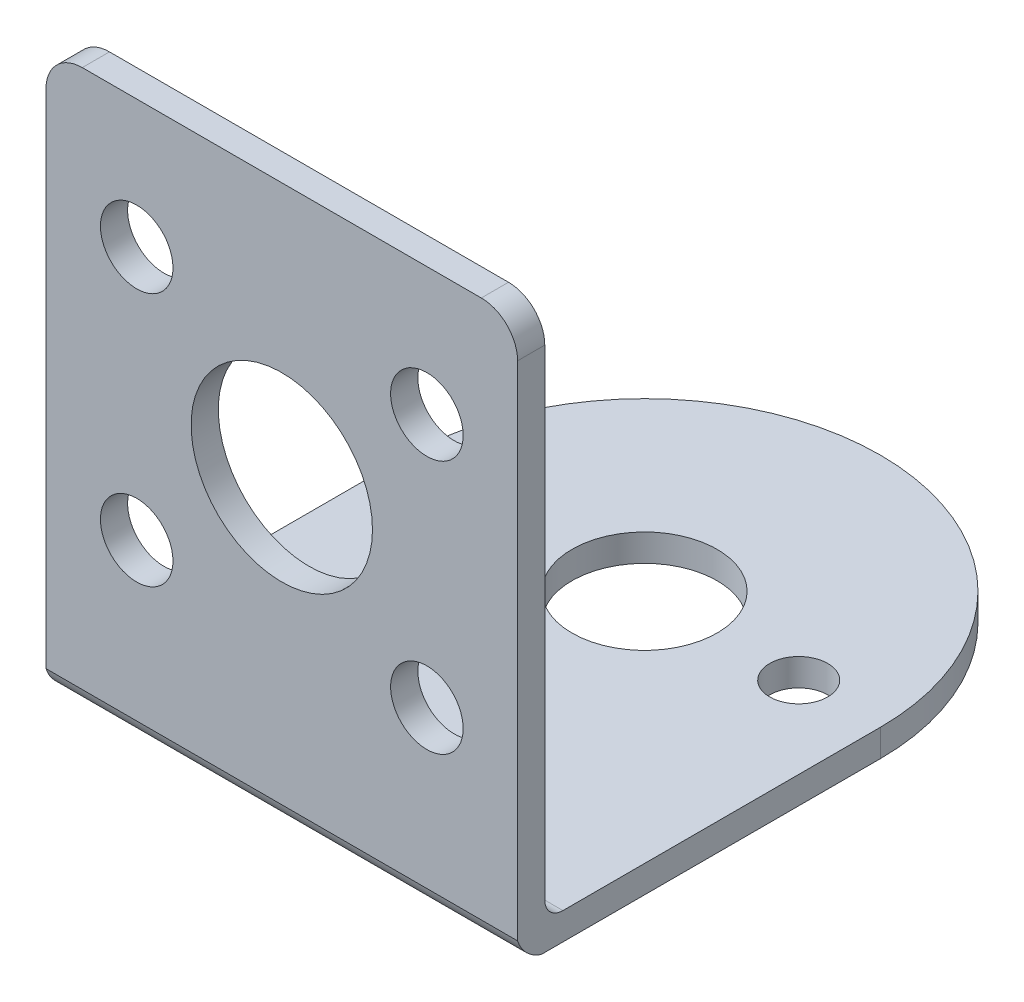
ISO-10303-21;
HEADER;
FILE_DESCRIPTION(('STEP AP214'),'2;1');
FILE_NAME('part.step','',(''),(''),'','','');
FILE_SCHEMA(('AUTOMOTIVE_DESIGN { 1 0 10303 214 1 1 1 1 }'));
ENDSEC;
DATA;
#1=APPLICATION_CONTEXT('core data for automotive mechanical design processes');
#2=APPLICATION_PROTOCOL_DEFINITION('international standard','automotive_design',2000,#1);
#3=PRODUCT_CONTEXT('',#1,'mechanical');
#4=PRODUCT('Part','Part','',(#3));
#5=PRODUCT_RELATED_PRODUCT_CATEGORY('part','',(#4));
#6=PRODUCT_DEFINITION_FORMATION('','',#4);
#7=PRODUCT_DEFINITION_CONTEXT('part definition',#1,'design');
#8=PRODUCT_DEFINITION('design','',#6,#7);
#9=PRODUCT_DEFINITION_SHAPE('','',#8);
#10=(LENGTH_UNIT() NAMED_UNIT(*) SI_UNIT(.MILLI.,.METRE.));
#11=(NAMED_UNIT(*) PLANE_ANGLE_UNIT() SI_UNIT($,.RADIAN.));
#12=(NAMED_UNIT(*) SI_UNIT($,.STERADIAN.) SOLID_ANGLE_UNIT());
#13=UNCERTAINTY_MEASURE_WITH_UNIT(LENGTH_MEASURE(1.E-05),#10,'distance_accuracy_value','');
#14=(GEOMETRIC_REPRESENTATION_CONTEXT(3) GLOBAL_UNCERTAINTY_ASSIGNED_CONTEXT((#13)) GLOBAL_UNIT_ASSIGNED_CONTEXT((#10,
#11,#12)) REPRESENTATION_CONTEXT('',''));
#15=CARTESIAN_POINT('',(0.,0.,0.));
#16=DIRECTION('',(0.,0.,1.));
#17=DIRECTION('',(1.,0.,0.));
#18=AXIS2_PLACEMENT_3D('',#15,#16,#17);
#19=CARTESIAN_POINT('',(0.,71.8431465541238,105.788232882787));
#20=DIRECTION('',(0.,-1.,0.));
#21=DIRECTION('',(0.,0.,-1.));
#22=AXIS2_PLACEMENT_3D('',#19,#20,#21);
#23=PLANE('',#22);
#24=CARTESIAN_POINT('',(-8.50000000000007,71.8431465541238,105.788232882787));
#25=DIRECTION('',(0.,1.,0.));
#26=DIRECTION('',(0.,0.,1.));
#27=AXIS2_PLACEMENT_3D('',#24,#25,#26);
#28=CIRCLE('',#27,1.6);
#29=CARTESIAN_POINT('',(-8.50000000000007,71.8431465541238,107.388232882787));
#30=VERTEX_POINT('',#29);
#31=EDGE_CURVE('E193',#30,#30,#28,.T.);
#32=ORIENTED_EDGE('',*,*,#31,.T.);
#33=EDGE_LOOP('',(#32));
#34=FACE_BOUND('',#33,.T.);
#35=CARTESIAN_POINT('',(0.,71.8431465541238,105.788232882787));
#36=DIRECTION('',(0.,1.,0.));
#37=DIRECTION('',(0.,0.,1.));
#38=AXIS2_PLACEMENT_3D('',#35,#36,#37);
#39=CIRCLE('',#38,4.);
#40=CARTESIAN_POINT('',(0.,71.8431465541238,109.788232882787));
#41=VERTEX_POINT('',#40);
#42=EDGE_CURVE('E199',#41,#41,#39,.T.);
#43=ORIENTED_EDGE('',*,*,#42,.T.);
#44=EDGE_LOOP('',(#43));
#45=FACE_BOUND('',#44,.T.);
#46=CARTESIAN_POINT('',(8.49999999999993,71.8431465541238,105.788232882787));
#47=DIRECTION('',(0.,1.,0.));
#48=DIRECTION('',(0.,0.,1.));
#49=AXIS2_PLACEMENT_3D('',#46,#47,#48);
#50=CIRCLE('',#49,1.6);
#51=CARTESIAN_POINT('',(8.49999999999993,71.8431465541238,107.388232882787));
#52=VERTEX_POINT('',#51);
#53=EDGE_CURVE('E186',#52,#52,#50,.T.);
#54=ORIENTED_EDGE('',*,*,#53,.T.);
#55=EDGE_LOOP('',(#54));
#56=FACE_BOUND('',#55,.T.);
#57=DIRECTION('',(0.,0.,-1.));
#58=VECTOR('',#57,1.);
#59=CARTESIAN_POINT('',(12.9999999999999,71.8431465541238,105.788232882787));
#60=LINE('',#59,#58);
#61=CARTESIAN_POINT('',(12.9999999999999,71.8431465541238,124.485329789312));
#62=VERTEX_POINT('',#61);
#63=CARTESIAN_POINT('',(12.9999999999999,71.8431465541238,105.788232882787));
#64=VERTEX_POINT('',#63);
#65=EDGE_CURVE('E124',#62,#64,#60,.T.);
#66=ORIENTED_EDGE('',*,*,#65,.F.);
#67=DIRECTION('',(-1.,0.,0.));
#68=VECTOR('',#67,1.);
#69=CARTESIAN_POINT('',(17.5,71.8431465541238,124.485329789312));
#70=LINE('',#69,#68);
#71=CARTESIAN_POINT('',(-13.0000000000001,71.8431465541238,124.485329789312));
#72=VERTEX_POINT('',#71);
#73=EDGE_CURVE('E112',#62,#72,#70,.T.);
#74=ORIENTED_EDGE('',*,*,#73,.T.);
#75=DIRECTION('',(0.,0.,1.));
#76=VECTOR('',#75,1.);
#77=CARTESIAN_POINT('',(-13.0000000000001,71.8431465541238,125.788232882787));
#78=LINE('',#77,#76);
#79=CARTESIAN_POINT('',(-13.0000000000001,71.8431465541238,105.788232882787));
#80=VERTEX_POINT('',#79);
#81=EDGE_CURVE('E123',#80,#72,#78,.T.);
#82=ORIENTED_EDGE('',*,*,#81,.F.);
#83=CARTESIAN_POINT('',(0.,71.8431465541238,105.788232882787));
#84=DIRECTION('',(0.,1.,0.));
#85=DIRECTION('',(0.,0.,-1.));
#86=AXIS2_PLACEMENT_3D('',#83,#84,#85);
#87=CIRCLE('',#86,13.);
#88=EDGE_CURVE('E131',#64,#80,#87,.T.);
#89=ORIENTED_EDGE('',*,*,#88,.F.);
#90=EDGE_LOOP('',(#66,#74,#82,#89));
#91=FACE_BOUND('',#90,.T.);
#92=ADVANCED_FACE('F34',(#34,#45,#56,#91),#23,.T.);
#93=CARTESIAN_POINT('',(12.9999999999999,73.3431465541238,125.788232882787));
#94=DIRECTION('',(0.,0.,-1.));
#95=DIRECTION('',(-1.,0.,0.));
#96=AXIS2_PLACEMENT_3D('',#93,#94,#95);
#97=PLANE('',#96);
#98=CARTESIAN_POINT('',(7.99999999999993,81.7793283916461,125.788232882787));
#99=DIRECTION('',(0.,0.,1.));
#100=DIRECTION('',(1.,0.,0.));
#101=AXIS2_PLACEMENT_3D('',#98,#99,#100);
#102=CIRCLE('',#101,2.);
#103=CARTESIAN_POINT('',(9.99999999999993,81.7793283916461,125.788232882787));
#104=VERTEX_POINT('',#103);
#105=EDGE_CURVE('E420',#104,#104,#102,.T.);
#106=ORIENTED_EDGE('',*,*,#105,.F.);
#107=EDGE_LOOP('',(#106));
#108=FACE_BOUND('',#107,.T.);
#109=CARTESIAN_POINT('',(-8.00000000000007,81.7793283916461,125.788232882787));
#110=DIRECTION('',(0.,0.,1.));
#111=DIRECTION('',(1.,0.,0.));
#112=AXIS2_PLACEMENT_3D('',#109,#110,#111);
#113=CIRCLE('',#112,2.);
#114=CARTESIAN_POINT('',(-6.00000000000007,81.7793283916461,125.788232882787));
#115=VERTEX_POINT('',#114);
#116=EDGE_CURVE('E422',#115,#115,#113,.T.);
#117=ORIENTED_EDGE('',*,*,#116,.F.);
#118=EDGE_LOOP('',(#117));
#119=FACE_BOUND('',#118,.T.);
#120=CARTESIAN_POINT('',(-8.00000000000007,95.7793283916461,125.788232882787));
#121=DIRECTION('',(0.,0.,1.));
#122=DIRECTION('',(1.,0.,0.));
#123=AXIS2_PLACEMENT_3D('',#120,#121,#122);
#124=CIRCLE('',#123,2.);
#125=CARTESIAN_POINT('',(-6.00000000000007,95.7793283916461,125.788232882787));
#126=VERTEX_POINT('',#125);
#127=EDGE_CURVE('E429',#126,#126,#124,.T.);
#128=ORIENTED_EDGE('',*,*,#127,.F.);
#129=EDGE_LOOP('',(#128));
#130=FACE_BOUND('',#129,.T.);
#131=CARTESIAN_POINT('',(7.99999999999993,95.7793283916461,125.788232882787));
#132=DIRECTION('',(0.,0.,1.));
#133=DIRECTION('',(1.,0.,0.));
#134=AXIS2_PLACEMENT_3D('',#131,#132,#133);
#135=CIRCLE('',#134,2.);
#136=CARTESIAN_POINT('',(9.99999999999993,95.7793283916461,125.788232882787));
#137=VERTEX_POINT('',#136);
#138=EDGE_CURVE('E435',#137,#137,#135,.T.);
#139=ORIENTED_EDGE('',*,*,#138,.F.);
#140=EDGE_LOOP('',(#139));
#141=FACE_BOUND('',#140,.T.);
#142=CARTESIAN_POINT('',(0.,88.7793283916461,125.788232882787));
#143=DIRECTION('',(0.,0.,1.));
#144=DIRECTION('',(1.,0.,0.));
#145=AXIS2_PLACEMENT_3D('',#142,#143,#144);
#146=CIRCLE('',#145,5.);
#147=CARTESIAN_POINT('',(4.99999999999993,88.7793283916461,125.788232882787));
#148=VERTEX_POINT('',#147);
#149=EDGE_CURVE('E441',#148,#148,#146,.T.);
#150=ORIENTED_EDGE('',*,*,#149,.F.);
#151=EDGE_LOOP('',(#150));
#152=FACE_BOUND('',#151,.T.);
#153=DIRECTION('',(-1.,0.,0.));
#154=VECTOR('',#153,1.);
#155=CARTESIAN_POINT('',(17.5,73.146049647599,125.788232882787));
#156=LINE('',#155,#154);
#157=CARTESIAN_POINT('',(12.9999999999999,73.146049647599,125.788232882787));
#158=VERTEX_POINT('',#157);
#159=CARTESIAN_POINT('',(-13.0000000000001,73.146049647599,125.788232882787));
#160=VERTEX_POINT('',#159);
#161=EDGE_CURVE('E115',#158,#160,#156,.T.);
#162=ORIENTED_EDGE('',*,*,#161,.F.);
#163=DIRECTION('',(0.,-1.,0.));
#164=VECTOR('',#163,1.);
#165=CARTESIAN_POINT('',(12.9999999999999,73.3431465541238,125.788232882787));
#166=LINE('',#165,#164);
#167=CARTESIAN_POINT('',(12.9999999999999,100.843146554124,125.788232882787));
#168=VERTEX_POINT('',#167);
#169=EDGE_CURVE('E145',#168,#158,#166,.T.);
#170=ORIENTED_EDGE('',*,*,#169,.F.);
#171=CARTESIAN_POINT('',(10.9999999999999,100.843146554124,125.788232882787));
#172=DIRECTION('',(0.,0.,1.));
#173=DIRECTION('',(1.,0.,0.));
#174=AXIS2_PLACEMENT_3D('',#171,#172,#173);
#175=CIRCLE('',#174,2.);
#176=CARTESIAN_POINT('',(10.9999999999999,102.843146554124,125.788232882787));
#177=VERTEX_POINT('',#176);
#178=EDGE_CURVE('E175',#168,#177,#175,.T.);
#179=ORIENTED_EDGE('',*,*,#178,.T.);
#180=DIRECTION('',(-1.,0.,0.));
#181=VECTOR('',#180,1.);
#182=CARTESIAN_POINT('',(-11.0000000000001,102.843146554124,125.788232882787));
#183=LINE('',#182,#181);
#184=CARTESIAN_POINT('',(-11.0000000000001,102.843146554124,125.788232882787));
#185=VERTEX_POINT('',#184);
#186=EDGE_CURVE('E178',#177,#185,#183,.T.);
#187=ORIENTED_EDGE('',*,*,#186,.T.);
#188=CARTESIAN_POINT('',(-11.0000000000001,100.843146554124,125.788232882787));
#189=DIRECTION('',(0.,0.,1.));
#190=DIRECTION('',(-1.,0.,0.));
#191=AXIS2_PLACEMENT_3D('',#188,#189,#190);
#192=CIRCLE('',#191,2.);
#193=CARTESIAN_POINT('',(-13.0000000000001,100.843146554124,125.788232882787));
#194=VERTEX_POINT('',#193);
#195=EDGE_CURVE('E182',#185,#194,#192,.T.);
#196=ORIENTED_EDGE('',*,*,#195,.T.);
#197=DIRECTION('',(0.,-1.,0.));
#198=VECTOR('',#197,1.);
#199=CARTESIAN_POINT('',(-13.0000000000001,73.3431465541238,125.788232882787));
#200=LINE('',#199,#198);
#201=EDGE_CURVE('E138',#194,#160,#200,.T.);
#202=ORIENTED_EDGE('',*,*,#201,.T.);
#203=EDGE_LOOP('',(#162,#170,#179,#187,#196,#202));
#204=FACE_BOUND('',#203,.T.);
#205=ADVANCED_FACE('F223',(#108,#119,#130,#141,#152,#204),#97,.F.);
#206=CARTESIAN_POINT('',(12.9999999999999,73.3431465541238,105.788232882787));
#207=DIRECTION('',(-1.,0.,0.));
#208=DIRECTION('',(0.,0.,1.));
#209=AXIS2_PLACEMENT_3D('',#206,#207,#208);
#210=PLANE('',#209);
#211=CARTESIAN_POINT('',(12.9999999999999,73.7498314983828,123.881547938528));
#212=DIRECTION('',(-1.,0.,0.));
#213=DIRECTION('',(0.,0.,1.));
#214=AXIS2_PLACEMENT_3D('',#211,#212,#213);
#215=CIRCLE('',#214,2.);
#216=EDGE_CURVE('E212',#62,#158,#215,.T.);
#217=ORIENTED_EDGE('',*,*,#216,.F.);
#218=ORIENTED_EDGE('',*,*,#65,.T.);
#219=DIRECTION('',(0.,-1.,0.));
#220=VECTOR('',#219,1.);
#221=CARTESIAN_POINT('',(12.9999999999999,73.3431465541238,105.788232882787));
#222=LINE('',#221,#220);
#223=CARTESIAN_POINT('',(12.9999999999999,73.3431465541238,105.788232882787));
#224=VERTEX_POINT('',#223);
#225=EDGE_CURVE('E142',#224,#64,#222,.T.);
#226=ORIENTED_EDGE('',*,*,#225,.F.);
#227=DIRECTION('',(0.,0.,-1.));
#228=VECTOR('',#227,1.);
#229=CARTESIAN_POINT('',(12.9999999999999,73.3431465541238,105.788232882787));
#230=LINE('',#229,#228);
#231=CARTESIAN_POINT('',(12.9999999999999,73.3431465541238,123.288232882787));
#232=VERTEX_POINT('',#231);
#233=EDGE_CURVE('E130',#232,#224,#230,.T.);
#234=ORIENTED_EDGE('',*,*,#233,.F.);
#235=CARTESIAN_POINT('',(12.9999999999999,74.3431465541238,123.288232882787));
#236=DIRECTION('',(-1.,0.,0.));
#237=DIRECTION('',(0.,0.,1.));
#238=AXIS2_PLACEMENT_3D('',#235,#236,#237);
#239=CIRCLE('',#238,1.);
#240=CARTESIAN_POINT('',(12.9999999999999,74.3431465541238,124.288232882787));
#241=VERTEX_POINT('',#240);
#242=EDGE_CURVE('E11',#232,#241,#239,.T.);
#243=ORIENTED_EDGE('',*,*,#242,.T.);
#244=DIRECTION('',(0.,1.,0.));
#245=VECTOR('',#244,1.);
#246=CARTESIAN_POINT('',(12.9999999999999,100.843146554124,124.288232882787));
#247=LINE('',#246,#245);
#248=CARTESIAN_POINT('',(12.9999999999999,100.843146554124,124.288232882787));
#249=VERTEX_POINT('',#248);
#250=EDGE_CURVE('E159',#241,#249,#247,.T.);
#251=ORIENTED_EDGE('',*,*,#250,.T.);
#252=DIRECTION('',(0.,0.,1.));
#253=VECTOR('',#252,1.);
#254=CARTESIAN_POINT('',(12.9999999999999,100.843146554124,124.288232882787));
#255=LINE('',#254,#253);
#256=EDGE_CURVE('E165',#249,#168,#255,.T.);
#257=ORIENTED_EDGE('',*,*,#256,.T.);
#258=ORIENTED_EDGE('',*,*,#169,.T.);
#259=EDGE_LOOP('',(#217,#218,#226,#234,#243,#251,#257,#258));
#260=FACE_BOUND('',#259,.T.);
#261=ADVANCED_FACE('F210',(#260),#210,.F.);
#262=CARTESIAN_POINT('',(-13.0000000000001,73.3431465541238,125.788232882787));
#263=DIRECTION('',(1.,0.,0.));
#264=DIRECTION('',(0.,0.,-1.));
#265=AXIS2_PLACEMENT_3D('',#262,#263,#264);
#266=PLANE('',#265);
#267=CARTESIAN_POINT('',(-13.0000000000001,73.7498314983828,123.881547938528));
#268=DIRECTION('',(-1.,0.,0.));
#269=DIRECTION('',(0.,0.,1.));
#270=AXIS2_PLACEMENT_3D('',#267,#268,#269);
#271=CIRCLE('',#270,2.);
#272=EDGE_CURVE('E109',#72,#160,#271,.T.);
#273=ORIENTED_EDGE('',*,*,#272,.T.);
#274=ORIENTED_EDGE('',*,*,#201,.F.);
#275=DIRECTION('',(0.,0.,1.));
#276=VECTOR('',#275,1.);
#277=CARTESIAN_POINT('',(-13.0000000000001,100.843146554124,124.288232882787));
#278=LINE('',#277,#276);
#279=CARTESIAN_POINT('',(-13.0000000000001,100.843146554124,124.288232882787));
#280=VERTEX_POINT('',#279);
#281=EDGE_CURVE('E163',#280,#194,#278,.T.);
#282=ORIENTED_EDGE('',*,*,#281,.F.);
#283=DIRECTION('',(0.,-1.,0.));
#284=VECTOR('',#283,1.);
#285=CARTESIAN_POINT('',(-13.0000000000001,71.8431465541238,124.288232882787));
#286=LINE('',#285,#284);
#287=CARTESIAN_POINT('',(-13.0000000000001,74.3431465541238,124.288232882787));
#288=VERTEX_POINT('',#287);
#289=EDGE_CURVE('E157',#280,#288,#286,.T.);
#290=ORIENTED_EDGE('',*,*,#289,.T.);
#291=CARTESIAN_POINT('',(-13.0000000000001,74.3431465541238,123.288232882787));
#292=DIRECTION('',(1.,0.,0.));
#293=DIRECTION('',(0.,0.,-1.));
#294=AXIS2_PLACEMENT_3D('',#291,#292,#293);
#295=CIRCLE('',#294,1.);
#296=CARTESIAN_POINT('',(-13.0000000000001,73.3431465541238,123.288232882787));
#297=VERTEX_POINT('',#296);
#298=EDGE_CURVE('E42',#288,#297,#295,.T.);
#299=ORIENTED_EDGE('',*,*,#298,.T.);
#300=DIRECTION('',(0.,0.,1.));
#301=VECTOR('',#300,1.);
#302=CARTESIAN_POINT('',(-13.0000000000001,73.3431465541238,125.788232882787));
#303=LINE('',#302,#301);
#304=CARTESIAN_POINT('',(-13.0000000000001,73.3431465541238,105.788232882787));
#305=VERTEX_POINT('',#304);
#306=EDGE_CURVE('E140',#305,#297,#303,.T.);
#307=ORIENTED_EDGE('',*,*,#306,.F.);
#308=DIRECTION('',(0.,-1.,0.));
#309=VECTOR('',#308,1.);
#310=CARTESIAN_POINT('',(-13.0000000000001,73.3431465541238,105.788232882787));
#311=LINE('',#310,#309);
#312=EDGE_CURVE('E129',#305,#80,#311,.T.);
#313=ORIENTED_EDGE('',*,*,#312,.T.);
#314=ORIENTED_EDGE('',*,*,#81,.T.);
#315=EDGE_LOOP('',(#273,#274,#282,#290,#299,#307,#313,#314));
#316=FACE_BOUND('',#315,.T.);
#317=ADVANCED_FACE('F127',(#316),#266,.F.);
#318=CARTESIAN_POINT('',(0.,73.3431465541238,105.788232882787));
#319=DIRECTION('',(0.,-1.,0.));
#320=DIRECTION('',(0.,0.,-1.));
#321=AXIS2_PLACEMENT_3D('',#318,#319,#320);
#322=PLANE('',#321);
#323=CARTESIAN_POINT('',(8.49999999999993,73.3431465541238,105.788232882787));
#324=DIRECTION('',(0.,1.,0.));
#325=DIRECTION('',(0.,0.,1.));
#326=AXIS2_PLACEMENT_3D('',#323,#324,#325);
#327=CIRCLE('',#326,1.6);
#328=CARTESIAN_POINT('',(8.49999999999993,73.3431465541238,107.388232882787));
#329=VERTEX_POINT('',#328);
#330=EDGE_CURVE('E190',#329,#329,#327,.T.);
#331=ORIENTED_EDGE('',*,*,#330,.F.);
#332=EDGE_LOOP('',(#331));
#333=FACE_BOUND('',#332,.T.);
#334=CARTESIAN_POINT('',(-8.50000000000007,73.3431465541238,105.788232882787));
#335=DIRECTION('',(0.,1.,0.));
#336=DIRECTION('',(0.,0.,1.));
#337=AXIS2_PLACEMENT_3D('',#334,#335,#336);
#338=CIRCLE('',#337,1.6);
#339=CARTESIAN_POINT('',(-8.50000000000007,73.3431465541238,107.388232882787));
#340=VERTEX_POINT('',#339);
#341=EDGE_CURVE('E196',#340,#340,#338,.T.);
#342=ORIENTED_EDGE('',*,*,#341,.F.);
#343=EDGE_LOOP('',(#342));
#344=FACE_BOUND('',#343,.T.);
#345=CARTESIAN_POINT('',(0.,73.3431465541238,105.788232882787));
#346=DIRECTION('',(0.,1.,0.));
#347=DIRECTION('',(0.,0.,1.));
#348=AXIS2_PLACEMENT_3D('',#345,#346,#347);
#349=CIRCLE('',#348,4.);
#350=CARTESIAN_POINT('',(0.,73.3431465541238,109.788232882787));
#351=VERTEX_POINT('',#350);
#352=EDGE_CURVE('E202',#351,#351,#349,.T.);
#353=ORIENTED_EDGE('',*,*,#352,.F.);
#354=EDGE_LOOP('',(#353));
#355=FACE_BOUND('',#354,.T.);
#356=ORIENTED_EDGE('',*,*,#306,.T.);
#357=DIRECTION('',(-1.,0.,0.));
#358=VECTOR('',#357,1.);
#359=CARTESIAN_POINT('',(12.9999999999999,73.3431465541238,123.288232882787));
#360=LINE('',#359,#358);
#361=EDGE_CURVE('E55',#297,#232,#360,.F.);
#362=ORIENTED_EDGE('',*,*,#361,.T.);
#363=ORIENTED_EDGE('',*,*,#233,.T.);
#364=CARTESIAN_POINT('',(0.,73.3431465541238,105.788232882787));
#365=DIRECTION('',(0.,1.,0.));
#366=DIRECTION('',(0.,0.,-1.));
#367=AXIS2_PLACEMENT_3D('',#364,#365,#366);
#368=CIRCLE('',#367,13.);
#369=EDGE_CURVE('E133',#224,#305,#368,.T.);
#370=ORIENTED_EDGE('',*,*,#369,.T.);
#371=EDGE_LOOP('',(#356,#362,#363,#370));
#372=FACE_BOUND('',#371,.T.);
#373=ADVANCED_FACE('F215',(#333,#344,#355,#372),#322,.F.);
#374=CARTESIAN_POINT('',(0.,73.3431465541238,105.788232882787));
#375=DIRECTION('',(0.,-1.,0.));
#376=DIRECTION('',(0.,0.,-1.));
#377=AXIS2_PLACEMENT_3D('',#374,#375,#376);
#378=CYLINDRICAL_SURFACE('',#377,13.);
#379=ORIENTED_EDGE('',*,*,#88,.T.);
#380=ORIENTED_EDGE('',*,*,#312,.F.);
#381=ORIENTED_EDGE('',*,*,#369,.F.);
#382=ORIENTED_EDGE('',*,*,#225,.T.);
#383=EDGE_LOOP('',(#379,#380,#381,#382));
#384=FACE_BOUND('',#383,.T.);
#385=ADVANCED_FACE('F214',(#384),#378,.T.);
#386=CARTESIAN_POINT('',(0.,73.3431465541238,105.788232882787));
#387=DIRECTION('',(0.,-1.,0.));
#388=DIRECTION('',(0.,0.,-1.));
#389=AXIS2_PLACEMENT_3D('',#386,#387,#388);
#390=CYLINDRICAL_SURFACE('',#389,4.);
#391=ORIENTED_EDGE('',*,*,#352,.T.);
#392=EDGE_LOOP('',(#391));
#393=FACE_BOUND('',#392,.T.);
#394=ORIENTED_EDGE('',*,*,#42,.F.);
#395=EDGE_LOOP('',(#394));
#396=FACE_BOUND('',#395,.T.);
#397=ADVANCED_FACE('F238',(#393,#396),#390,.F.);
#398=CARTESIAN_POINT('',(-8.50000000000007,73.3431465541238,105.788232882787));
#399=DIRECTION('',(0.,-1.,0.));
#400=DIRECTION('',(0.,0.,-1.));
#401=AXIS2_PLACEMENT_3D('',#398,#399,#400);
#402=CYLINDRICAL_SURFACE('',#401,1.6);
#403=ORIENTED_EDGE('',*,*,#341,.T.);
#404=EDGE_LOOP('',(#403));
#405=FACE_BOUND('',#404,.T.);
#406=ORIENTED_EDGE('',*,*,#31,.F.);
#407=EDGE_LOOP('',(#406));
#408=FACE_BOUND('',#407,.T.);
#409=ADVANCED_FACE('F264',(#405,#408),#402,.F.);
#410=CARTESIAN_POINT('',(8.49999999999993,73.3431465541238,105.788232882787));
#411=DIRECTION('',(0.,-1.,0.));
#412=DIRECTION('',(0.,0.,-1.));
#413=AXIS2_PLACEMENT_3D('',#410,#411,#412);
#414=CYLINDRICAL_SURFACE('',#413,1.6);
#415=ORIENTED_EDGE('',*,*,#330,.T.);
#416=EDGE_LOOP('',(#415));
#417=FACE_BOUND('',#416,.T.);
#418=ORIENTED_EDGE('',*,*,#53,.F.);
#419=EDGE_LOOP('',(#418));
#420=FACE_BOUND('',#419,.T.);
#421=ADVANCED_FACE('F271',(#417,#420),#414,.F.);
#422=CARTESIAN_POINT('',(10.9999999999999,100.843146554124,124.288232882787));
#423=DIRECTION('',(0.,0.,1.));
#424=DIRECTION('',(1.,0.,0.));
#425=AXIS2_PLACEMENT_3D('',#422,#423,#424);
#426=PLANE('',#425);
#427=CARTESIAN_POINT('',(7.99999999999993,81.7793283916461,124.288232882787));
#428=DIRECTION('',(0.,0.,1.));
#429=DIRECTION('',(1.,0.,0.));
#430=AXIS2_PLACEMENT_3D('',#427,#428,#429);
#431=CIRCLE('',#430,2.);
#432=CARTESIAN_POINT('',(9.99999999999993,81.7793283916461,124.288232882787));
#433=VERTEX_POINT('',#432);
#434=EDGE_CURVE('E417',#433,#433,#431,.T.);
#435=ORIENTED_EDGE('',*,*,#434,.T.);
#436=EDGE_LOOP('',(#435));
#437=FACE_BOUND('',#436,.T.);
#438=CARTESIAN_POINT('',(-8.00000000000007,81.7793283916461,124.288232882787));
#439=DIRECTION('',(0.,0.,1.));
#440=DIRECTION('',(1.,0.,0.));
#441=AXIS2_PLACEMENT_3D('',#438,#439,#440);
#442=CIRCLE('',#441,2.);
#443=CARTESIAN_POINT('',(-6.00000000000007,81.7793283916461,124.288232882787));
#444=VERTEX_POINT('',#443);
#445=EDGE_CURVE('E426',#444,#444,#442,.T.);
#446=ORIENTED_EDGE('',*,*,#445,.T.);
#447=EDGE_LOOP('',(#446));
#448=FACE_BOUND('',#447,.T.);
#449=CARTESIAN_POINT('',(-8.00000000000007,95.7793283916461,124.288232882787));
#450=DIRECTION('',(0.,0.,1.));
#451=DIRECTION('',(1.,0.,0.));
#452=AXIS2_PLACEMENT_3D('',#449,#450,#451);
#453=CIRCLE('',#452,2.);
#454=CARTESIAN_POINT('',(-6.00000000000007,95.7793283916461,124.288232882787));
#455=VERTEX_POINT('',#454);
#456=EDGE_CURVE('E432',#455,#455,#453,.T.);
#457=ORIENTED_EDGE('',*,*,#456,.T.);
#458=EDGE_LOOP('',(#457));
#459=FACE_BOUND('',#458,.T.);
#460=CARTESIAN_POINT('',(7.99999999999993,95.7793283916461,124.288232882787));
#461=DIRECTION('',(0.,0.,1.));
#462=DIRECTION('',(1.,0.,0.));
#463=AXIS2_PLACEMENT_3D('',#460,#461,#462);
#464=CIRCLE('',#463,2.);
#465=CARTESIAN_POINT('',(9.99999999999993,95.7793283916461,124.288232882787));
#466=VERTEX_POINT('',#465);
#467=EDGE_CURVE('E438',#466,#466,#464,.T.);
#468=ORIENTED_EDGE('',*,*,#467,.T.);
#469=EDGE_LOOP('',(#468));
#470=FACE_BOUND('',#469,.T.);
#471=CARTESIAN_POINT('',(0.,88.7793283916461,124.288232882787));
#472=DIRECTION('',(0.,0.,1.));
#473=DIRECTION('',(1.,0.,0.));
#474=AXIS2_PLACEMENT_3D('',#471,#472,#473);
#475=CIRCLE('',#474,5.);
#476=CARTESIAN_POINT('',(4.99999999999993,88.7793283916461,124.288232882787));
#477=VERTEX_POINT('',#476);
#478=EDGE_CURVE('E179',#477,#477,#475,.T.);
#479=ORIENTED_EDGE('',*,*,#478,.T.);
#480=EDGE_LOOP('',(#479));
#481=FACE_BOUND('',#480,.T.);
#482=ORIENTED_EDGE('',*,*,#250,.F.);
#483=DIRECTION('',(-1.,0.,0.));
#484=VECTOR('',#483,1.);
#485=CARTESIAN_POINT('',(-13.0000000000001,74.3431465541238,124.288232882787));
#486=LINE('',#485,#484);
#487=EDGE_CURVE('E148',#241,#288,#486,.T.);
#488=ORIENTED_EDGE('',*,*,#487,.T.);
#489=ORIENTED_EDGE('',*,*,#289,.F.);
#490=CARTESIAN_POINT('',(-11.0000000000001,100.843146554124,124.288232882787));
#491=DIRECTION('',(0.,0.,1.));
#492=DIRECTION('',(-1.,0.,0.));
#493=AXIS2_PLACEMENT_3D('',#490,#491,#492);
#494=CIRCLE('',#493,2.);
#495=CARTESIAN_POINT('',(-11.0000000000001,102.843146554124,124.288232882787));
#496=VERTEX_POINT('',#495);
#497=EDGE_CURVE('E166',#496,#280,#494,.T.);
#498=ORIENTED_EDGE('',*,*,#497,.F.);
#499=DIRECTION('',(-1.,0.,0.));
#500=VECTOR('',#499,1.);
#501=CARTESIAN_POINT('',(-11.0000000000001,102.843146554124,124.288232882787));
#502=LINE('',#501,#500);
#503=CARTESIAN_POINT('',(10.9999999999999,102.843146554124,124.288232882787));
#504=VERTEX_POINT('',#503);
#505=EDGE_CURVE('E171',#504,#496,#502,.T.);
#506=ORIENTED_EDGE('',*,*,#505,.F.);
#507=CARTESIAN_POINT('',(10.9999999999999,100.843146554124,124.288232882787));
#508=DIRECTION('',(0.,0.,1.));
#509=DIRECTION('',(1.,0.,0.));
#510=AXIS2_PLACEMENT_3D('',#507,#508,#509);
#511=CIRCLE('',#510,2.);
#512=EDGE_CURVE('E449',#249,#504,#511,.T.);
#513=ORIENTED_EDGE('',*,*,#512,.F.);
#514=EDGE_LOOP('',(#482,#488,#489,#498,#506,#513));
#515=FACE_BOUND('',#514,.T.);
#516=ADVANCED_FACE('F155',(#437,#448,#459,#470,#481,#515),#426,.F.);
#517=CARTESIAN_POINT('',(-11.0000000000001,100.843146554124,124.288232882787));
#518=DIRECTION('',(0.,0.,1.));
#519=DIRECTION('',(1.,0.,0.));
#520=AXIS2_PLACEMENT_3D('',#517,#518,#519);
#521=CYLINDRICAL_SURFACE('',#520,2.);
#522=ORIENTED_EDGE('',*,*,#195,.F.);
#523=DIRECTION('',(0.,0.,1.));
#524=VECTOR('',#523,1.);
#525=CARTESIAN_POINT('',(-11.0000000000001,102.843146554124,124.288232882787));
#526=LINE('',#525,#524);
#527=EDGE_CURVE('E187',#496,#185,#526,.T.);
#528=ORIENTED_EDGE('',*,*,#527,.F.);
#529=ORIENTED_EDGE('',*,*,#497,.T.);
#530=ORIENTED_EDGE('',*,*,#281,.T.);
#531=EDGE_LOOP('',(#522,#528,#529,#530));
#532=FACE_BOUND('',#531,.T.);
#533=ADVANCED_FACE('F286',(#532),#521,.T.);
#534=CARTESIAN_POINT('',(-11.0000000000001,102.843146554124,124.288232882787));
#535=DIRECTION('',(0.,1.,0.));
#536=DIRECTION('',(0.,0.,1.));
#537=AXIS2_PLACEMENT_3D('',#534,#535,#536);
#538=PLANE('',#537);
#539=ORIENTED_EDGE('',*,*,#186,.F.);
#540=DIRECTION('',(0.,0.,1.));
#541=VECTOR('',#540,1.);
#542=CARTESIAN_POINT('',(10.9999999999999,102.843146554124,124.288232882787));
#543=LINE('',#542,#541);
#544=EDGE_CURVE('E169',#504,#177,#543,.T.);
#545=ORIENTED_EDGE('',*,*,#544,.F.);
#546=ORIENTED_EDGE('',*,*,#505,.T.);
#547=ORIENTED_EDGE('',*,*,#527,.T.);
#548=EDGE_LOOP('',(#539,#545,#546,#547));
#549=FACE_BOUND('',#548,.T.);
#550=ADVANCED_FACE('F294',(#549),#538,.T.);
#551=CARTESIAN_POINT('',(10.9999999999999,100.843146554124,124.288232882787));
#552=DIRECTION('',(0.,0.,1.));
#553=DIRECTION('',(1.,0.,0.));
#554=AXIS2_PLACEMENT_3D('',#551,#552,#553);
#555=CYLINDRICAL_SURFACE('',#554,2.);
#556=ORIENTED_EDGE('',*,*,#178,.F.);
#557=ORIENTED_EDGE('',*,*,#256,.F.);
#558=ORIENTED_EDGE('',*,*,#512,.T.);
#559=ORIENTED_EDGE('',*,*,#544,.T.);
#560=EDGE_LOOP('',(#556,#557,#558,#559));
#561=FACE_BOUND('',#560,.T.);
#562=ADVANCED_FACE('F302',(#561),#555,.T.);
#563=CARTESIAN_POINT('',(0.,88.7793283916461,124.288232882787));
#564=DIRECTION('',(0.,0.,1.));
#565=DIRECTION('',(1.,0.,0.));
#566=AXIS2_PLACEMENT_3D('',#563,#564,#565);
#567=CYLINDRICAL_SURFACE('',#566,5.);
#568=ORIENTED_EDGE('',*,*,#478,.F.);
#569=EDGE_LOOP('',(#568));
#570=FACE_BOUND('',#569,.T.);
#571=ORIENTED_EDGE('',*,*,#149,.T.);
#572=EDGE_LOOP('',(#571));
#573=FACE_BOUND('',#572,.T.);
#574=ADVANCED_FACE('F310',(#570,#573),#567,.F.);
#575=CARTESIAN_POINT('',(7.99999999999993,95.7793283916461,124.288232882787));
#576=DIRECTION('',(0.,0.,1.));
#577=DIRECTION('',(1.,0.,0.));
#578=AXIS2_PLACEMENT_3D('',#575,#576,#577);
#579=CYLINDRICAL_SURFACE('',#578,2.);
#580=ORIENTED_EDGE('',*,*,#467,.F.);
#581=EDGE_LOOP('',(#580));
#582=FACE_BOUND('',#581,.T.);
#583=ORIENTED_EDGE('',*,*,#138,.T.);
#584=EDGE_LOOP('',(#583));
#585=FACE_BOUND('',#584,.T.);
#586=ADVANCED_FACE('F318',(#582,#585),#579,.F.);
#587=CARTESIAN_POINT('',(-8.00000000000007,95.7793283916461,124.288232882787));
#588=DIRECTION('',(0.,0.,1.));
#589=DIRECTION('',(1.,0.,0.));
#590=AXIS2_PLACEMENT_3D('',#587,#588,#589);
#591=CYLINDRICAL_SURFACE('',#590,2.);
#592=ORIENTED_EDGE('',*,*,#456,.F.);
#593=EDGE_LOOP('',(#592));
#594=FACE_BOUND('',#593,.T.);
#595=ORIENTED_EDGE('',*,*,#127,.T.);
#596=EDGE_LOOP('',(#595));
#597=FACE_BOUND('',#596,.T.);
#598=ADVANCED_FACE('F326',(#594,#597),#591,.F.);
#599=CARTESIAN_POINT('',(-8.00000000000007,81.7793283916461,124.288232882787));
#600=DIRECTION('',(0.,0.,1.));
#601=DIRECTION('',(1.,0.,0.));
#602=AXIS2_PLACEMENT_3D('',#599,#600,#601);
#603=CYLINDRICAL_SURFACE('',#602,2.);
#604=ORIENTED_EDGE('',*,*,#445,.F.);
#605=EDGE_LOOP('',(#604));
#606=FACE_BOUND('',#605,.T.);
#607=ORIENTED_EDGE('',*,*,#116,.T.);
#608=EDGE_LOOP('',(#607));
#609=FACE_BOUND('',#608,.T.);
#610=ADVANCED_FACE('F334',(#606,#609),#603,.F.);
#611=CARTESIAN_POINT('',(7.99999999999993,81.7793283916461,124.288232882787));
#612=DIRECTION('',(0.,0.,1.));
#613=DIRECTION('',(1.,0.,0.));
#614=AXIS2_PLACEMENT_3D('',#611,#612,#613);
#615=CYLINDRICAL_SURFACE('',#614,2.);
#616=ORIENTED_EDGE('',*,*,#434,.F.);
#617=EDGE_LOOP('',(#616));
#618=FACE_BOUND('',#617,.T.);
#619=ORIENTED_EDGE('',*,*,#105,.T.);
#620=EDGE_LOOP('',(#619));
#621=FACE_BOUND('',#620,.T.);
#622=ADVANCED_FACE('F220',(#618,#621),#615,.F.);
#623=CARTESIAN_POINT('',(17.5,73.7498314983828,123.881547938528));
#624=DIRECTION('',(-1.,0.,0.));
#625=DIRECTION('',(0.,0.,1.));
#626=AXIS2_PLACEMENT_3D('',#623,#624,#625);
#627=CYLINDRICAL_SURFACE('',#626,2.);
#628=ORIENTED_EDGE('',*,*,#216,.T.);
#629=ORIENTED_EDGE('',*,*,#161,.T.);
#630=ORIENTED_EDGE('',*,*,#272,.F.);
#631=ORIENTED_EDGE('',*,*,#73,.F.);
#632=EDGE_LOOP('',(#628,#629,#630,#631));
#633=FACE_BOUND('',#632,.T.);
#634=ADVANCED_FACE('F111',(#633),#627,.T.);
#635=CARTESIAN_POINT('',(10.9999999999999,74.3431465541238,123.288232882787));
#636=DIRECTION('',(1.,0.,0.));
#637=DIRECTION('',(0.,0.,-1.));
#638=AXIS2_PLACEMENT_3D('',#635,#636,#637);
#639=CYLINDRICAL_SURFACE('',#638,1.);
#640=ORIENTED_EDGE('',*,*,#242,.F.);
#641=ORIENTED_EDGE('',*,*,#361,.F.);
#642=ORIENTED_EDGE('',*,*,#298,.F.);
#643=ORIENTED_EDGE('',*,*,#487,.F.);
#644=EDGE_LOOP('',(#640,#641,#642,#643));
#645=FACE_BOUND('',#644,.T.);
#646=ADVANCED_FACE('F36',(#645),#639,.F.);
#647=CLOSED_SHELL('',(#92,#205,#261,#317,#373,#385,#397,#409,#421,#516,#533,#550,#562,#574,#586,
#598,#610,#622,#634,#646));
#648=MANIFOLD_SOLID_BREP('B2',#647);
#649=ADVANCED_BREP_SHAPE_REPRESENTATION('',(#18,#648),#14);
#650=SHAPE_DEFINITION_REPRESENTATION(#9,#649);
ENDSEC;
END-ISO-10303-21;
